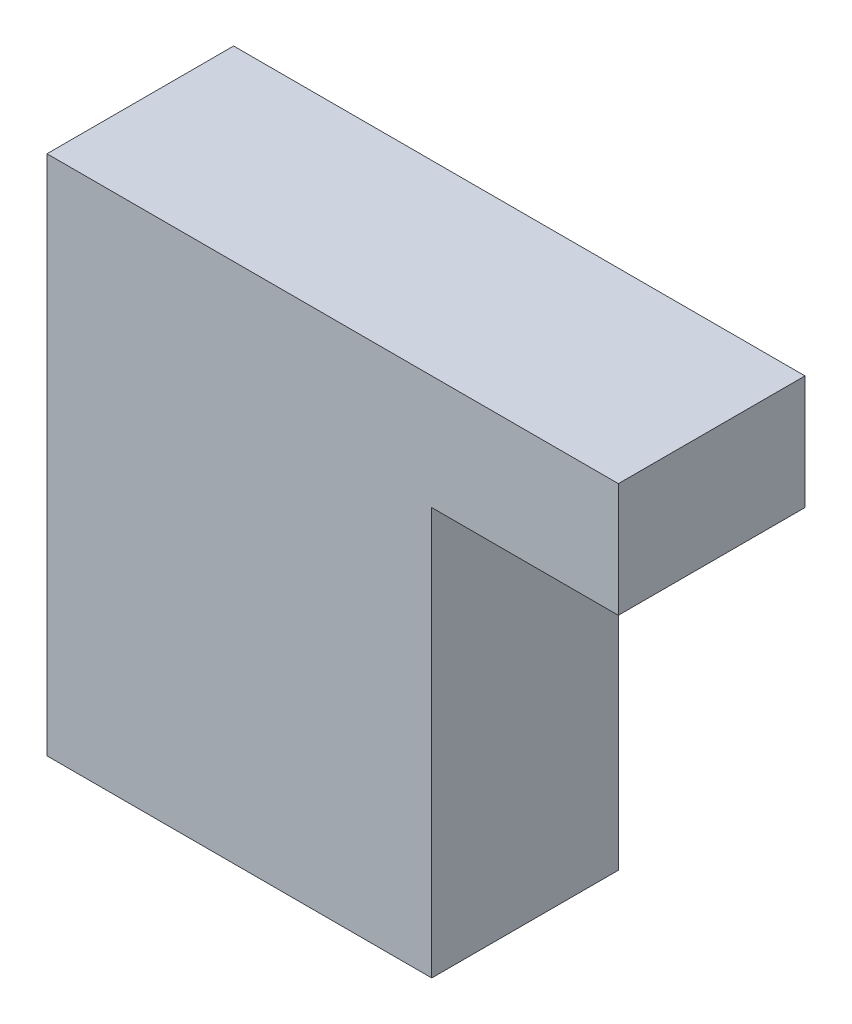
ISO-10303-21;
HEADER;
FILE_DESCRIPTION(('STEP AP214'),'2;1');
FILE_NAME('part.step','',(''),(''),'','','');
FILE_SCHEMA(('AUTOMOTIVE_DESIGN { 1 0 10303 214 1 1 1 1 }'));
ENDSEC;
DATA;
#1=APPLICATION_CONTEXT('core data for automotive mechanical design processes');
#2=APPLICATION_PROTOCOL_DEFINITION('international standard','automotive_design',2000,#1);
#3=PRODUCT_CONTEXT('',#1,'mechanical');
#4=PRODUCT('Part','Part','',(#3));
#5=PRODUCT_RELATED_PRODUCT_CATEGORY('part','',(#4));
#6=PRODUCT_DEFINITION_FORMATION('','',#4);
#7=PRODUCT_DEFINITION_CONTEXT('part definition',#1,'design');
#8=PRODUCT_DEFINITION('design','',#6,#7);
#9=PRODUCT_DEFINITION_SHAPE('','',#8);
#10=(LENGTH_UNIT() NAMED_UNIT(*) SI_UNIT(.MILLI.,.METRE.));
#11=(NAMED_UNIT(*) PLANE_ANGLE_UNIT() SI_UNIT($,.RADIAN.));
#12=(NAMED_UNIT(*) SI_UNIT($,.STERADIAN.) SOLID_ANGLE_UNIT());
#13=UNCERTAINTY_MEASURE_WITH_UNIT(LENGTH_MEASURE(1.E-05),#10,'distance_accuracy_value','');
#14=(GEOMETRIC_REPRESENTATION_CONTEXT(3) GLOBAL_UNCERTAINTY_ASSIGNED_CONTEXT((#13)) GLOBAL_UNIT_ASSIGNED_CONTEXT((#10,
#11,#12)) REPRESENTATION_CONTEXT('',''));
#15=CARTESIAN_POINT('',(0.,0.,0.));
#16=DIRECTION('',(0.,0.,1.));
#17=DIRECTION('',(1.,0.,0.));
#18=AXIS2_PLACEMENT_3D('',#15,#16,#17);
#19=CARTESIAN_POINT('',(20.6158407723318,0.,10.));
#20=DIRECTION('',(-1.,0.,0.));
#21=DIRECTION('',(0.,0.,1.));
#22=AXIS2_PLACEMENT_3D('',#19,#20,#21);
#23=PLANE('',#22);
#24=DIRECTION('',(0.,0.,-1.));
#25=VECTOR('',#24,1.);
#26=CARTESIAN_POINT('',(20.6158407723318,-6.1104338478799,10.));
#27=LINE('',#26,#25);
#28=CARTESIAN_POINT('',(20.6158407723318,-6.1104338478799,10.));
#29=VERTEX_POINT('',#28);
#30=CARTESIAN_POINT('',(20.6158407723318,-6.1104338478799,0.));
#31=VERTEX_POINT('',#30);
#32=EDGE_CURVE('E48',#29,#31,#27,.T.);
#33=ORIENTED_EDGE('',*,*,#32,.F.);
#34=DIRECTION('',(0.,1.,0.));
#35=VECTOR('',#34,1.);
#36=CARTESIAN_POINT('',(20.6158407723318,0.,10.));
#37=LINE('',#36,#35);
#38=CARTESIAN_POINT('',(20.6158407723318,-27.9398894677655,10.));
#39=VERTEX_POINT('',#38);
#40=EDGE_CURVE('E113',#39,#29,#37,.T.);
#41=ORIENTED_EDGE('',*,*,#40,.F.);
#42=DIRECTION('',(0.,0.,-1.));
#43=VECTOR('',#42,1.);
#44=CARTESIAN_POINT('',(20.6158407723318,-27.9398894677655,10.));
#45=LINE('',#44,#43);
#46=CARTESIAN_POINT('',(20.6158407723318,-27.9398894677655,0.));
#47=VERTEX_POINT('',#46);
#48=EDGE_CURVE('E41',#39,#47,#45,.T.);
#49=ORIENTED_EDGE('',*,*,#48,.T.);
#50=DIRECTION('',(0.,1.,0.));
#51=VECTOR('',#50,1.);
#52=CARTESIAN_POINT('',(20.6158407723318,0.,0.));
#53=LINE('',#52,#51);
#54=EDGE_CURVE('E129',#47,#31,#53,.T.);
#55=ORIENTED_EDGE('',*,*,#54,.T.);
#56=EDGE_LOOP('',(#33,#41,#49,#55));
#57=FACE_BOUND('',#56,.T.);
#58=ADVANCED_FACE('F33',(#57),#23,.F.);
#59=CARTESIAN_POINT('',(0.,0.,10.));
#60=DIRECTION('',(1.,0.,0.));
#61=DIRECTION('',(0.,0.,-1.));
#62=AXIS2_PLACEMENT_3D('',#59,#60,#61);
#63=PLANE('',#62);
#64=DIRECTION('',(0.,-1.,0.));
#65=VECTOR('',#64,1.);
#66=CARTESIAN_POINT('',(0.,0.,0.));
#67=LINE('',#66,#65);
#68=CARTESIAN_POINT('',(0.,0.,0.));
#69=VERTEX_POINT('',#68);
#70=CARTESIAN_POINT('',(0.,-27.9398894677655,0.));
#71=VERTEX_POINT('',#70);
#72=EDGE_CURVE('E114',#69,#71,#67,.T.);
#73=ORIENTED_EDGE('',*,*,#72,.T.);
#74=DIRECTION('',(0.,0.,-1.));
#75=VECTOR('',#74,1.);
#76=CARTESIAN_POINT('',(0.,-27.9398894677655,10.));
#77=LINE('',#76,#75);
#78=CARTESIAN_POINT('',(0.,-27.9398894677655,10.));
#79=VERTEX_POINT('',#78);
#80=EDGE_CURVE('E11',#79,#71,#77,.T.);
#81=ORIENTED_EDGE('',*,*,#80,.F.);
#82=DIRECTION('',(0.,-1.,0.));
#83=VECTOR('',#82,1.);
#84=CARTESIAN_POINT('',(0.,0.,10.));
#85=LINE('',#84,#83);
#86=CARTESIAN_POINT('',(0.,0.,10.));
#87=VERTEX_POINT('',#86);
#88=EDGE_CURVE('E122',#87,#79,#85,.T.);
#89=ORIENTED_EDGE('',*,*,#88,.F.);
#90=DIRECTION('',(0.,0.,-1.));
#91=VECTOR('',#90,1.);
#92=CARTESIAN_POINT('',(0.,0.,10.));
#93=LINE('',#92,#91);
#94=EDGE_CURVE('E126',#87,#69,#93,.T.);
#95=ORIENTED_EDGE('',*,*,#94,.T.);
#96=EDGE_LOOP('',(#73,#81,#89,#95));
#97=FACE_BOUND('',#96,.T.);
#98=ADVANCED_FACE('F35',(#97),#63,.F.);
#99=CARTESIAN_POINT('',(0.,-27.9398894677655,10.));
#100=DIRECTION('',(0.,1.,0.));
#101=DIRECTION('',(0.,0.,1.));
#102=AXIS2_PLACEMENT_3D('',#99,#100,#101);
#103=PLANE('',#102);
#104=DIRECTION('',(1.,0.,0.));
#105=VECTOR('',#104,1.);
#106=CARTESIAN_POINT('',(0.,-27.9398894677655,0.));
#107=LINE('',#106,#105);
#108=EDGE_CURVE('E117',#71,#47,#107,.T.);
#109=ORIENTED_EDGE('',*,*,#108,.T.);
#110=ORIENTED_EDGE('',*,*,#48,.F.);
#111=DIRECTION('',(1.,0.,0.));
#112=VECTOR('',#111,1.);
#113=CARTESIAN_POINT('',(0.,-27.9398894677655,10.));
#114=LINE('',#113,#112);
#115=EDGE_CURVE('E80',#79,#39,#114,.T.);
#116=ORIENTED_EDGE('',*,*,#115,.F.);
#117=ORIENTED_EDGE('',*,*,#80,.T.);
#118=EDGE_LOOP('',(#109,#110,#116,#117));
#119=FACE_BOUND('',#118,.T.);
#120=ADVANCED_FACE('F143',(#119),#103,.F.);
#121=CARTESIAN_POINT('',(0.,0.,10.));
#122=DIRECTION('',(0.,-1.,0.));
#123=DIRECTION('',(0.,0.,-1.));
#124=AXIS2_PLACEMENT_3D('',#121,#122,#123);
#125=PLANE('',#124);
#126=DIRECTION('',(-1.,0.,0.));
#127=VECTOR('',#126,1.);
#128=CARTESIAN_POINT('',(0.,0.,0.));
#129=LINE('',#128,#127);
#130=CARTESIAN_POINT('',(30.6158407723318,0.,0.));
#131=VERTEX_POINT('',#130);
#132=EDGE_CURVE('E75',#131,#69,#129,.T.);
#133=ORIENTED_EDGE('',*,*,#132,.T.);
#134=ORIENTED_EDGE('',*,*,#94,.F.);
#135=DIRECTION('',(-1.,0.,0.));
#136=VECTOR('',#135,1.);
#137=CARTESIAN_POINT('',(0.,0.,10.));
#138=LINE('',#137,#136);
#139=CARTESIAN_POINT('',(30.6158407723318,0.,10.));
#140=VERTEX_POINT('',#139);
#141=EDGE_CURVE('E57',#140,#87,#138,.T.);
#142=ORIENTED_EDGE('',*,*,#141,.F.);
#143=DIRECTION('',(0.,0.,1.));
#144=VECTOR('',#143,1.);
#145=CARTESIAN_POINT('',(30.6158407723318,0.,10.));
#146=LINE('',#145,#144);
#147=EDGE_CURVE('E110',#131,#140,#146,.T.);
#148=ORIENTED_EDGE('',*,*,#147,.F.);
#149=EDGE_LOOP('',(#133,#134,#142,#148));
#150=FACE_BOUND('',#149,.T.);
#151=ADVANCED_FACE('F139',(#150),#125,.F.);
#152=CARTESIAN_POINT('',(0.,0.,10.));
#153=DIRECTION('',(0.,0.,1.));
#154=DIRECTION('',(1.,0.,0.));
#155=AXIS2_PLACEMENT_3D('',#152,#153,#154);
#156=PLANE('',#155);
#157=ORIENTED_EDGE('',*,*,#88,.T.);
#158=ORIENTED_EDGE('',*,*,#115,.T.);
#159=ORIENTED_EDGE('',*,*,#40,.T.);
#160=DIRECTION('',(-1.,0.,0.));
#161=VECTOR('',#160,1.);
#162=CARTESIAN_POINT('',(30.6158407723318,-6.1104338478799,10.));
#163=LINE('',#162,#161);
#164=CARTESIAN_POINT('',(30.6158407723318,-6.1104338478799,10.));
#165=VERTEX_POINT('',#164);
#166=EDGE_CURVE('E99',#165,#29,#163,.T.);
#167=ORIENTED_EDGE('',*,*,#166,.F.);
#168=DIRECTION('',(0.,-1.,0.));
#169=VECTOR('',#168,1.);
#170=CARTESIAN_POINT('',(30.6158407723318,0.,10.));
#171=LINE('',#170,#169);
#172=EDGE_CURVE('E106',#140,#165,#171,.T.);
#173=ORIENTED_EDGE('',*,*,#172,.F.);
#174=ORIENTED_EDGE('',*,*,#141,.T.);
#175=EDGE_LOOP('',(#157,#158,#159,#167,#173,#174));
#176=FACE_BOUND('',#175,.T.);
#177=ADVANCED_FACE('F112',(#176),#156,.T.);
#178=CARTESIAN_POINT('',(0.,0.,0.));
#179=DIRECTION('',(0.,0.,1.));
#180=DIRECTION('',(1.,0.,0.));
#181=AXIS2_PLACEMENT_3D('',#178,#179,#180);
#182=PLANE('',#181);
#183=ORIENTED_EDGE('',*,*,#72,.F.);
#184=ORIENTED_EDGE('',*,*,#132,.F.);
#185=DIRECTION('',(0.,1.,0.));
#186=VECTOR('',#185,1.);
#187=CARTESIAN_POINT('',(30.6158407723318,0.,0.));
#188=LINE('',#187,#186);
#189=CARTESIAN_POINT('',(30.6158407723318,-6.1104338478799,0.));
#190=VERTEX_POINT('',#189);
#191=EDGE_CURVE('E105',#190,#131,#188,.T.);
#192=ORIENTED_EDGE('',*,*,#191,.F.);
#193=DIRECTION('',(-1.,0.,0.));
#194=VECTOR('',#193,1.);
#195=CARTESIAN_POINT('',(30.6158407723318,-6.1104338478799,0.));
#196=LINE('',#195,#194);
#197=EDGE_CURVE('E101',#190,#31,#196,.T.);
#198=ORIENTED_EDGE('',*,*,#197,.T.);
#199=ORIENTED_EDGE('',*,*,#54,.F.);
#200=ORIENTED_EDGE('',*,*,#108,.F.);
#201=EDGE_LOOP('',(#183,#184,#192,#198,#199,#200));
#202=FACE_BOUND('',#201,.T.);
#203=ADVANCED_FACE('F136',(#202),#182,.F.);
#204=CARTESIAN_POINT('',(30.6158407723318,-6.1104338478799,10.));
#205=DIRECTION('',(0.,1.,0.));
#206=DIRECTION('',(0.,0.,1.));
#207=AXIS2_PLACEMENT_3D('',#204,#205,#206);
#208=PLANE('',#207);
#209=ORIENTED_EDGE('',*,*,#32,.T.);
#210=ORIENTED_EDGE('',*,*,#197,.F.);
#211=DIRECTION('',(0.,0.,-1.));
#212=VECTOR('',#211,1.);
#213=CARTESIAN_POINT('',(30.6158407723318,-6.1104338478799,10.));
#214=LINE('',#213,#212);
#215=EDGE_CURVE('E95',#165,#190,#214,.T.);
#216=ORIENTED_EDGE('',*,*,#215,.F.);
#217=ORIENTED_EDGE('',*,*,#166,.T.);
#218=EDGE_LOOP('',(#209,#210,#216,#217));
#219=FACE_BOUND('',#218,.T.);
#220=ADVANCED_FACE('F97',(#219),#208,.F.);
#221=CARTESIAN_POINT('',(30.6158407723318,0.,0.));
#222=DIRECTION('',(1.,0.,0.));
#223=DIRECTION('',(0.,0.,-1.));
#224=AXIS2_PLACEMENT_3D('',#221,#222,#223);
#225=PLANE('',#224);
#226=ORIENTED_EDGE('',*,*,#172,.T.);
#227=ORIENTED_EDGE('',*,*,#215,.T.);
#228=ORIENTED_EDGE('',*,*,#191,.T.);
#229=ORIENTED_EDGE('',*,*,#147,.T.);
#230=EDGE_LOOP('',(#226,#227,#228,#229));
#231=FACE_BOUND('',#230,.T.);
#232=ADVANCED_FACE('F109',(#231),#225,.T.);
#233=CLOSED_SHELL('',(#58,#98,#120,#151,#177,#203,#220,#232));
#234=MANIFOLD_SOLID_BREP('B2',#233);
#235=ADVANCED_BREP_SHAPE_REPRESENTATION('',(#18,#234),#14);
#236=SHAPE_DEFINITION_REPRESENTATION(#9,#235);
ENDSEC;
END-ISO-10303-21;
